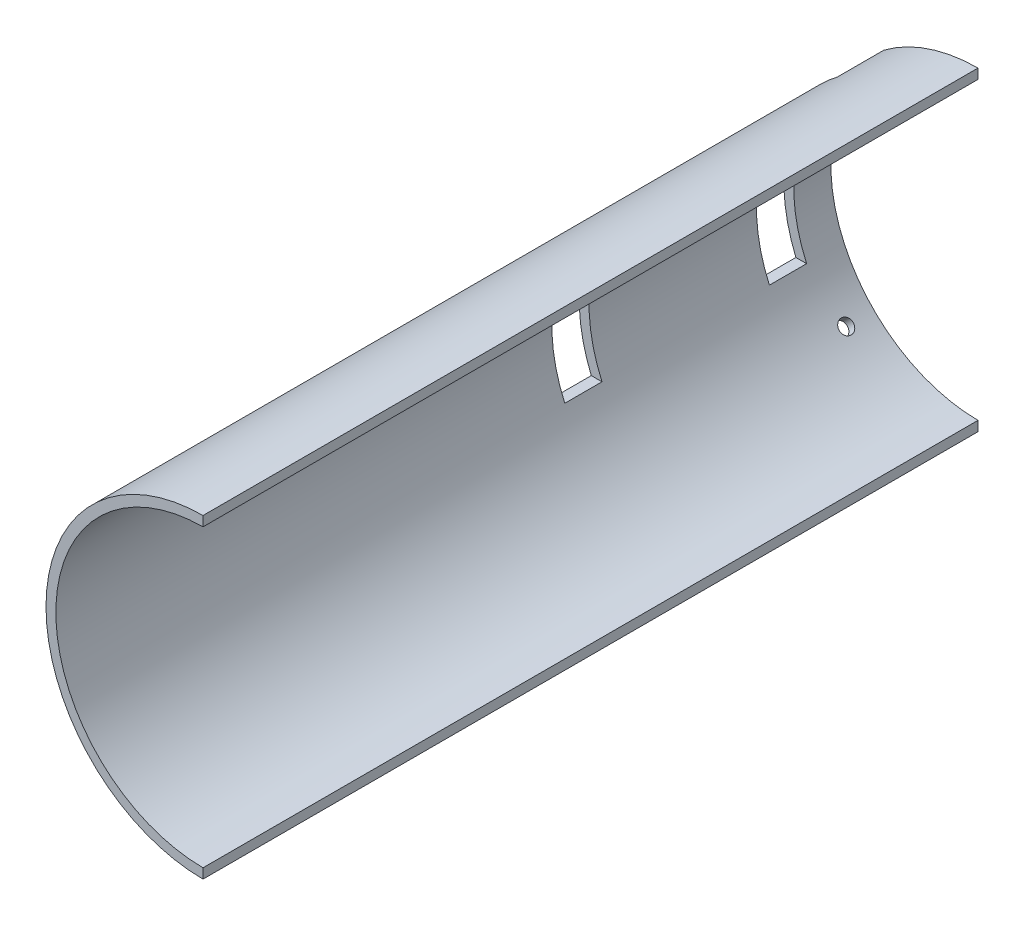
ISO-10303-21;
HEADER;
FILE_DESCRIPTION(('STEP AP214'),'2;1');
FILE_NAME('part.step','',(''),(''),'','','');
FILE_SCHEMA(('AUTOMOTIVE_DESIGN { 1 0 10303 214 1 1 1 1 }'));
ENDSEC;
DATA;
#1=APPLICATION_CONTEXT('core data for automotive mechanical design processes');
#2=APPLICATION_PROTOCOL_DEFINITION('international standard','automotive_design',2000,#1);
#3=PRODUCT_CONTEXT('',#1,'mechanical');
#4=PRODUCT('Part','Part','',(#3));
#5=PRODUCT_RELATED_PRODUCT_CATEGORY('part','',(#4));
#6=PRODUCT_DEFINITION_FORMATION('','',#4);
#7=PRODUCT_DEFINITION_CONTEXT('part definition',#1,'design');
#8=PRODUCT_DEFINITION('design','',#6,#7);
#9=PRODUCT_DEFINITION_SHAPE('','',#8);
#10=(LENGTH_UNIT() NAMED_UNIT(*) SI_UNIT(.MILLI.,.METRE.));
#11=(NAMED_UNIT(*) PLANE_ANGLE_UNIT() SI_UNIT($,.RADIAN.));
#12=(NAMED_UNIT(*) SI_UNIT($,.STERADIAN.) SOLID_ANGLE_UNIT());
#13=UNCERTAINTY_MEASURE_WITH_UNIT(LENGTH_MEASURE(1.E-05),#10,'distance_accuracy_value','');
#14=(GEOMETRIC_REPRESENTATION_CONTEXT(3) GLOBAL_UNCERTAINTY_ASSIGNED_CONTEXT((#13)) GLOBAL_UNIT_ASSIGNED_CONTEXT((#10,
#11,#12)) REPRESENTATION_CONTEXT('',''));
#15=CARTESIAN_POINT('',(0.,0.,0.));
#16=DIRECTION('',(0.,0.,1.));
#17=DIRECTION('',(1.,0.,0.));
#18=AXIS2_PLACEMENT_3D('',#15,#16,#17);
#19=CARTESIAN_POINT('',(0.,0.,250.));
#20=DIRECTION('',(0.,0.,-1.));
#21=DIRECTION('',(-1.,0.,0.));
#22=AXIS2_PLACEMENT_3D('',#19,#20,#21);
#23=CYLINDRICAL_SURFACE('',#22,50.8);
#24=CARTESIAN_POINT('',(0.,0.,250.));
#25=DIRECTION('',(0.,0.,1.));
#26=DIRECTION('',(1.,0.,0.));
#27=AXIS2_PLACEMENT_3D('',#24,#25,#26);
#28=CIRCLE('',#27,50.8);
#29=CARTESIAN_POINT('',(-0.150000000000013,50.7997785428243,250.));
#30=VERTEX_POINT('',#29);
#31=CARTESIAN_POINT('',(-0.150000000000013,-50.7997785428244,250.));
#32=VERTEX_POINT('',#31);
#33=EDGE_CURVE('E163',#30,#32,#28,.T.);
#34=ORIENTED_EDGE('',*,*,#33,.F.);
#35=DIRECTION('',(0.,0.,-1.));
#36=VECTOR('',#35,1.);
#37=CARTESIAN_POINT('',(-0.15,50.7997785428244,250.));
#38=LINE('',#37,#36);
#39=CARTESIAN_POINT('',(-0.15,50.7997785428244,0.));
#40=VERTEX_POINT('',#39);
#41=EDGE_CURVE('E366',#30,#40,#38,.T.);
#42=ORIENTED_EDGE('',*,*,#41,.T.);
#43=CARTESIAN_POINT('',(0.,0.,0.));
#44=DIRECTION('',(0.,0.,1.));
#45=DIRECTION('',(1.,0.,0.));
#46=AXIS2_PLACEMENT_3D('',#43,#44,#45);
#47=CIRCLE('',#46,50.8);
#48=CARTESIAN_POINT('',(-30.5400452331846,40.5948966885622,0.));
#49=VERTEX_POINT('',#48);
#50=EDGE_CURVE('E164',#40,#49,#47,.T.);
#51=ORIENTED_EDGE('',*,*,#50,.T.);
#52=DIRECTION('',(0.,0.,-1.));
#53=VECTOR('',#52,1.);
#54=CARTESIAN_POINT('',(-30.5400452331846,40.5948966885622,15.));
#55=LINE('',#54,#53);
#56=CARTESIAN_POINT('',(-30.5400452331846,40.5948966885622,15.));
#57=VERTEX_POINT('',#56);
#58=EDGE_CURVE('E194',#57,#49,#55,.T.);
#59=ORIENTED_EDGE('',*,*,#58,.F.);
#60=CARTESIAN_POINT('',(0.,0.,15.));
#61=DIRECTION('',(0.,0.,-1.));
#62=DIRECTION('',(-1.,0.,0.));
#63=AXIS2_PLACEMENT_3D('',#60,#61,#62);
#64=CIRCLE('',#63,50.8);
#65=CARTESIAN_POINT('',(-40.5948966885624,30.5400452331844,15.));
#66=VERTEX_POINT('',#65);
#67=EDGE_CURVE('E217',#66,#57,#64,.T.);
#68=ORIENTED_EDGE('',*,*,#67,.F.);
#69=DIRECTION('',(0.,0.,-1.));
#70=VECTOR('',#69,1.);
#71=CARTESIAN_POINT('',(-40.5948966885624,30.5400452331844,15.));
#72=LINE('',#71,#70);
#73=CARTESIAN_POINT('',(-40.5948966885624,30.5400452331844,0.));
#74=VERTEX_POINT('',#73);
#75=EDGE_CURVE('E219',#66,#74,#72,.T.);
#76=ORIENTED_EDGE('',*,*,#75,.T.);
#77=CARTESIAN_POINT('',(-40.5948966885625,-30.5400452331841,0.));
#78=VERTEX_POINT('',#77);
#79=EDGE_CURVE('E168',#74,#78,#47,.T.);
#80=ORIENTED_EDGE('',*,*,#79,.T.);
#81=DIRECTION('',(0.,0.,-1.));
#82=VECTOR('',#81,1.);
#83=CARTESIAN_POINT('',(-40.5948966885625,-30.5400452331841,15.));
#84=LINE('',#83,#82);
#85=CARTESIAN_POINT('',(-40.5948966885625,-30.5400452331841,15.));
#86=VERTEX_POINT('',#85);
#87=EDGE_CURVE('E198',#86,#78,#84,.T.);
#88=ORIENTED_EDGE('',*,*,#87,.F.);
#89=CARTESIAN_POINT('',(0.,0.,15.));
#90=DIRECTION('',(0.,0.,-1.));
#91=DIRECTION('',(0.,-1.,0.));
#92=AXIS2_PLACEMENT_3D('',#89,#90,#91);
#93=CIRCLE('',#92,50.8);
#94=CARTESIAN_POINT('',(-30.5400452331848,-40.594896688562,15.));
#95=VERTEX_POINT('',#94);
#96=EDGE_CURVE('E209',#95,#86,#93,.T.);
#97=ORIENTED_EDGE('',*,*,#96,.F.);
#98=DIRECTION('',(0.,0.,-1.));
#99=VECTOR('',#98,1.);
#100=CARTESIAN_POINT('',(-30.5400452331848,-40.594896688562,15.));
#101=LINE('',#100,#99);
#102=CARTESIAN_POINT('',(-30.5400452331848,-40.594896688562,0.));
#103=VERTEX_POINT('',#102);
#104=EDGE_CURVE('E203',#95,#103,#101,.T.);
#105=ORIENTED_EDGE('',*,*,#104,.T.);
#106=CARTESIAN_POINT('',(-0.150000000000013,-50.7997785428244,0.));
#107=VERTEX_POINT('',#106);
#108=EDGE_CURVE('E170',#103,#107,#47,.T.);
#109=ORIENTED_EDGE('',*,*,#108,.T.);
#110=DIRECTION('',(0.,0.,-1.));
#111=VECTOR('',#110,1.);
#112=CARTESIAN_POINT('',(-0.150000000000013,-50.7997785428244,250.));
#113=LINE('',#112,#111);
#114=EDGE_CURVE('E55',#107,#32,#113,.F.);
#115=ORIENTED_EDGE('',*,*,#114,.T.);
#116=EDGE_LOOP('',(#34,#42,#51,#59,#68,#76,#80,#88,#97,#105,#109,#115));
#117=FACE_BOUND('',#116,.T.);
#118=CARTESIAN_POINT('',(0.,0.,78.));
#119=DIRECTION('',(0.,0.,-1.));
#120=DIRECTION('',(-1.,0.,0.));
#121=AXIS2_PLACEMENT_3D('',#118,#119,#120);
#122=CIRCLE('',#121,50.8);
#123=CARTESIAN_POINT('',(-46.9083148279705,-19.5,78.));
#124=VERTEX_POINT('',#123);
#125=CARTESIAN_POINT('',(-46.9083148279705,19.5,78.));
#126=VERTEX_POINT('',#125);
#127=EDGE_CURVE('E258',#124,#126,#122,.T.);
#128=ORIENTED_EDGE('',*,*,#127,.T.);
#129=DIRECTION('',(0.,0.,-1.));
#130=VECTOR('',#129,1.);
#131=CARTESIAN_POINT('',(-46.9083148279705,19.5,250.));
#132=LINE('',#131,#130);
#133=CARTESIAN_POINT('',(-46.9083148279705,19.5,90.));
#134=VERTEX_POINT('',#133);
#135=EDGE_CURVE('E248',#134,#126,#132,.T.);
#136=ORIENTED_EDGE('',*,*,#135,.F.);
#137=CARTESIAN_POINT('',(0.,0.,90.));
#138=DIRECTION('',(0.,0.,-1.));
#139=DIRECTION('',(-1.,0.,0.));
#140=AXIS2_PLACEMENT_3D('',#137,#138,#139);
#141=CIRCLE('',#140,50.8);
#142=CARTESIAN_POINT('',(-46.9083148279705,-19.5,90.));
#143=VERTEX_POINT('',#142);
#144=EDGE_CURVE('E263',#143,#134,#141,.T.);
#145=ORIENTED_EDGE('',*,*,#144,.F.);
#146=DIRECTION('',(0.,0.,-1.));
#147=VECTOR('',#146,1.);
#148=CARTESIAN_POINT('',(-46.9083148279705,-19.5,250.));
#149=LINE('',#148,#147);
#150=EDGE_CURVE('E260',#143,#124,#149,.T.);
#151=ORIENTED_EDGE('',*,*,#150,.T.);
#152=EDGE_LOOP('',(#128,#136,#145,#151));
#153=FACE_BOUND('',#152,.T.);
#154=CARTESIAN_POINT('',(0.,0.,24.));
#155=DIRECTION('',(0.,0.,-1.));
#156=DIRECTION('',(0.,1.,0.));
#157=AXIS2_PLACEMENT_3D('',#154,#155,#156);
#158=CIRCLE('',#157,50.8);
#159=CARTESIAN_POINT('',(-46.9083148279705,-19.5000000000002,24.));
#160=VERTEX_POINT('',#159);
#161=CARTESIAN_POINT('',(-46.9083148279706,19.4999999999998,24.));
#162=VERTEX_POINT('',#161);
#163=EDGE_CURVE('E238',#160,#162,#158,.T.);
#164=ORIENTED_EDGE('',*,*,#163,.F.);
#165=DIRECTION('',(0.,0.,-1.));
#166=VECTOR('',#165,1.);
#167=CARTESIAN_POINT('',(-46.9083148279705,-19.5000000000001,250.));
#168=LINE('',#167,#166);
#169=CARTESIAN_POINT('',(-46.9083148279705,-19.5000000000002,12.));
#170=VERTEX_POINT('',#169);
#171=EDGE_CURVE('E228',#170,#160,#168,.F.);
#172=ORIENTED_EDGE('',*,*,#171,.F.);
#173=CARTESIAN_POINT('',(0.,0.,12.));
#174=DIRECTION('',(0.,0.,1.));
#175=DIRECTION('',(1.,0.,0.));
#176=AXIS2_PLACEMENT_3D('',#173,#174,#175);
#177=CIRCLE('',#176,50.8);
#178=CARTESIAN_POINT('',(-46.9083148279706,19.4999999999998,12.));
#179=VERTEX_POINT('',#178);
#180=EDGE_CURVE('E242',#179,#170,#177,.T.);
#181=ORIENTED_EDGE('',*,*,#180,.F.);
#182=DIRECTION('',(0.,0.,-1.));
#183=VECTOR('',#182,1.);
#184=CARTESIAN_POINT('',(-46.9083148279706,19.4999999999998,250.));
#185=LINE('',#184,#183);
#186=EDGE_CURVE('E240',#162,#179,#185,.T.);
#187=ORIENTED_EDGE('',*,*,#186,.F.);
#188=EDGE_LOOP('',(#164,#172,#181,#187));
#189=FACE_BOUND('',#188,.T.);
#190=ADVANCED_FACE('F34',(#117,#153,#189),#23,.T.);
#191=CARTESIAN_POINT('',(0.,0.,250.));
#192=DIRECTION('',(0.,0.,-1.));
#193=DIRECTION('',(-1.,0.,0.));
#194=AXIS2_PLACEMENT_3D('',#191,#192,#193);
#195=CYLINDRICAL_SURFACE('',#194,47.62);
#196=CARTESIAN_POINT('',(0.,0.,90.));
#197=DIRECTION('',(0.,0.,-1.));
#198=DIRECTION('',(-1.,0.,0.));
#199=AXIS2_PLACEMENT_3D('',#196,#197,#198);
#200=CIRCLE('',#199,47.62);
#201=CARTESIAN_POINT('',(-43.4443828359893,19.5,90.));
#202=VERTEX_POINT('',#201);
#203=CARTESIAN_POINT('',(-43.4443828359893,-19.5,90.));
#204=VERTEX_POINT('',#203);
#205=EDGE_CURVE('E181',#202,#204,#200,.F.);
#206=ORIENTED_EDGE('',*,*,#205,.F.);
#207=DIRECTION('',(0.,0.,-1.));
#208=VECTOR('',#207,1.);
#209=CARTESIAN_POINT('',(-43.4443828359893,19.5,250.));
#210=LINE('',#209,#208);
#211=CARTESIAN_POINT('',(-43.4443828359893,19.5,78.));
#212=VERTEX_POINT('',#211);
#213=EDGE_CURVE('E173',#212,#202,#210,.F.);
#214=ORIENTED_EDGE('',*,*,#213,.F.);
#215=CARTESIAN_POINT('',(0.,0.,78.));
#216=DIRECTION('',(0.,0.,-1.));
#217=DIRECTION('',(-1.,0.,0.));
#218=AXIS2_PLACEMENT_3D('',#215,#216,#217);
#219=CIRCLE('',#218,47.62);
#220=CARTESIAN_POINT('',(-43.4443828359893,-19.5,78.));
#221=VERTEX_POINT('',#220);
#222=EDGE_CURVE('E175',#212,#221,#219,.F.);
#223=ORIENTED_EDGE('',*,*,#222,.T.);
#224=DIRECTION('',(0.,0.,-1.));
#225=VECTOR('',#224,1.);
#226=CARTESIAN_POINT('',(-43.4443828359893,-19.5,250.));
#227=LINE('',#226,#225);
#228=EDGE_CURVE('E178',#221,#204,#227,.F.);
#229=ORIENTED_EDGE('',*,*,#228,.T.);
#230=EDGE_LOOP('',(#206,#214,#223,#229));
#231=FACE_BOUND('',#230,.T.);
#232=CARTESIAN_POINT('',(-32.0438272682221,-35.2258077835604,9.));
#233=CARTESIAN_POINT('',(-32.0438317176606,-35.2258043452638,9.12630778286549));
#234=CARTESIAN_POINT('',(-32.0517327135354,-35.2186214642248,9.25270535517174));
#235=CARTESIAN_POINT('',(-32.0831099876524,-35.1900395925316,9.50201425056569));
#236=CARTESIAN_POINT('',(-32.1066046597982,-35.1686238130729,9.62492127754036));
#237=CARTESIAN_POINT('',(-32.1684073118102,-35.1121021084725,9.86360147571088));
#238=CARTESIAN_POINT('',(-32.2067077911385,-35.0770031150932,9.97937822469137));
#239=CARTESIAN_POINT('',(-32.2968885961961,-34.993986981455,10.2005446278164));
#240=CARTESIAN_POINT('',(-32.3487656981291,-34.9460728841092,10.3059367396472));
#241=CARTESIAN_POINT('',(-32.4645135177405,-34.8385703926164,10.503470617082));
#242=CARTESIAN_POINT('',(-32.5283938237228,-34.7789726637837,10.5956016849744));
#243=CARTESIAN_POINT('',(-32.6661343175636,-34.6496316751259,10.7639071148954));
#244=CARTESIAN_POINT('',(-32.7399949109112,-34.5798880030726,10.840080828272));
#245=CARTESIAN_POINT('',(-32.8954652816068,-34.4320237607884,10.9743375279386));
#246=CARTESIAN_POINT('',(-32.9770785295229,-34.3538994368165,11.032412361777));
#247=CARTESIAN_POINT('',(-33.1455637198012,-34.1913686855799,11.1287703955119));
#248=CARTESIAN_POINT('',(-33.2324356254946,-34.1069623021194,11.1670537333979));
#249=CARTESIAN_POINT('',(-33.4087989560948,-33.9342270868281,11.2227142875572));
#250=CARTESIAN_POINT('',(-33.498288356545,-33.8459012604379,11.2401072449115));
#251=CARTESIAN_POINT('',(-33.6773561204862,-33.667729875027,11.2535418857352));
#252=CARTESIAN_POINT('',(-33.7669344833303,-33.5778843269855,11.2495837233886));
#253=CARTESIAN_POINT('',(-33.9435736803794,-33.3993109279266,11.220441567235));
#254=CARTESIAN_POINT('',(-34.0306364672355,-33.310582241911,11.1952745204841));
#255=CARTESIAN_POINT('',(-34.1999202965766,-33.1367557311199,11.124455259503));
#256=CARTESIAN_POINT('',(-34.2821413203619,-33.051657920368,11.078802966161));
#257=CARTESIAN_POINT('',(-34.4395665146779,-32.8875904242239,10.9682897674777));
#258=CARTESIAN_POINT('',(-34.5147678457146,-32.8086232208425,10.9034211329494));
#259=CARTESIAN_POINT('',(-34.6561484973245,-32.6592462440519,10.7563222882677));
#260=CARTESIAN_POINT('',(-34.7223277613815,-32.588836524249,10.6740919693651));
#261=CARTESIAN_POINT('',(-34.8440313252382,-32.4586790584133,10.4945081487276));
#262=CARTESIAN_POINT('',(-34.8995451479171,-32.3989418003937,10.397139944514));
#263=CARTESIAN_POINT('',(-34.9984414575166,-32.2920859277433,10.1900959598985));
#264=CARTESIAN_POINT('',(-35.0418239414631,-32.2449673162062,10.0804201764791));
#265=CARTESIAN_POINT('',(-35.1153829411626,-32.1648449986058,9.85186547552728));
#266=CARTESIAN_POINT('',(-35.1455590845932,-32.1318416904916,9.73298629863749));
#267=CARTESIAN_POINT('',(-35.1919616334504,-32.0810135587657,9.48940334781121));
#268=CARTESIAN_POINT('',(-35.2081881325768,-32.063188633201,9.36469961300419));
#269=CARTESIAN_POINT('',(-35.2262860346658,-32.043304398133,9.11313653740183));
#270=CARTESIAN_POINT('',(-35.2281713015452,-32.0412298624599,8.98627939730371));
#271=CARTESIAN_POINT('',(-35.2175773789759,-32.0528735548305,8.7338970421207));
#272=CARTESIAN_POINT('',(-35.2050982318605,-32.0665917363316,8.60837182311161));
#273=CARTESIAN_POINT('',(-35.1660889155332,-32.1093665305668,8.36227422305958));
#274=CARTESIAN_POINT('',(-35.1395651045954,-32.1384162024376,8.24169962737464));
#275=CARTESIAN_POINT('',(-35.0731193588191,-32.2109158878136,8.00885775451115));
#276=CARTESIAN_POINT('',(-35.0331973548627,-32.254365975607,7.89659052019187));
#277=CARTESIAN_POINT('',(-34.9409040075854,-32.3543233664124,7.6834555680646));
#278=CARTESIAN_POINT('',(-34.8885231219751,-32.4108406767122,7.58259667573459));
#279=CARTESIAN_POINT('',(-34.7726379788124,-32.5351386761527,7.39523017534742));
#280=CARTESIAN_POINT('',(-34.7091336573104,-32.6029194300476,7.30872264980292));
#281=CARTESIAN_POINT('',(-34.5725635329844,-32.7477043956557,7.15244546512262));
#282=CARTESIAN_POINT('',(-34.4994902130569,-32.8247158546494,7.08268908853794));
#283=CARTESIAN_POINT('',(-34.3457257783463,-32.9855708420563,6.96198512360319));
#284=CARTESIAN_POINT('',(-34.2650346940645,-33.0694143431139,6.9110374599474));
#285=CARTESIAN_POINT('',(-34.0982267238973,-33.2413848400652,6.8294203826961));
#286=CARTESIAN_POINT('',(-34.0121121329903,-33.329510020589,6.7987424541953));
#287=CARTESIAN_POINT('',(-33.8367889952503,-33.507487336346,6.75850779156319));
#288=CARTESIAN_POINT('',(-33.7475804634085,-33.5973394632107,6.74895095510887));
#289=CARTESIAN_POINT('',(-33.5686679189427,-33.7760996930285,6.75123075715785));
#290=CARTESIAN_POINT('',(-33.4789644741016,-33.8650086308576,6.76304654977187));
#291=CARTESIAN_POINT('',(-33.3015560065154,-34.0394807961206,6.80769313909201));
#292=CARTESIAN_POINT('',(-33.2138509875739,-34.1250440171868,6.84052397579308));
#293=CARTESIAN_POINT('',(-33.0430157899659,-34.2904893420114,6.92626456071771));
#294=CARTESIAN_POINT('',(-32.9598856544803,-34.3703713921491,6.97917449842435));
#295=CARTESIAN_POINT('',(-32.8006925644056,-34.5223274396228,7.10356750226263));
#296=CARTESIAN_POINT('',(-32.7246293865441,-34.5944016836493,7.17504998134511));
#297=CARTESIAN_POINT('',(-32.5818218431517,-34.728935136089,7.33463268471658));
#298=CARTESIAN_POINT('',(-32.5150856083365,-34.7913859601392,7.42274725261249));
#299=CARTESIAN_POINT('',(-32.3930642636242,-34.9050248528353,7.61308699964514));
#300=CARTESIAN_POINT('',(-32.337781978139,-34.956210143724,7.71531564882038));
#301=CARTESIAN_POINT('',(-32.2403871329649,-35.0460589215576,7.93105526626097));
#302=CARTESIAN_POINT('',(-32.1982865650781,-35.0847110078044,8.04457638464772));
#303=CARTESIAN_POINT('',(-32.1287069515606,-35.1484400335049,8.27952036326755));
#304=CARTESIAN_POINT('',(-32.1012106079417,-35.1735330336465,8.40093368330762));
#305=CARTESIAN_POINT('',(-32.0689491523498,-35.2029425642609,8.60258624730247));
#306=CARTESIAN_POINT('',(-32.0595417666715,-35.2115074234496,8.68151886590007));
#307=CARTESIAN_POINT('',(-32.046979420133,-35.2229411180766,8.84028902137894));
#308=CARTESIAN_POINT('',(-32.0438244545239,-35.2258099578413,8.92012655757285));
#309=CARTESIAN_POINT('',(-32.0438272682221,-35.2258077835604,9.));
#310=B_SPLINE_CURVE_WITH_KNOTS('',3,(#232,#233,#234,#235,#236,#237,#238,#239,#240,#241,#242,
#243,#244,#245,#246,#247,#248,#249,#250,#251,#252,#253,#254,#255,#256,#257,#258,#259,#260,#261,
#262,#263,#264,#265,#266,#267,#268,#269,#270,#271,#272,#273,#274,#275,#276,#277,#278,#279,#280,
#281,#282,#283,#284,#285,#286,#287,#288,#289,#290,#291,#292,#293,#294,#295,#296,#297,#298,#299,
#300,#301,#302,#303,#304,#305,#306,#307,#308,#309),.UNSPECIFIED.,.T.,.F.,(4,2,2,2,2,2,2,2,2,2,2,
2,2,2,2,2,2,2,2,2,2,2,2,2,2,2,2,2,2,2,2,2,2,2,2,2,2,2,4),(0.,0.378631783224871,
0.757710986511355,1.1365984015579,1.5153959305247,1.89449734389449,2.27361416440516,
2.65290150813592,3.0321862073799,3.41118493269032,3.79018092111968,4.16887435790151,
4.54756925717147,4.92641668220433,5.3052664803106,5.684486556974,6.06370672660917,
6.44293758679779,6.82216589967434,7.20102755934902,7.57988810248495,7.95857727503818,
8.3372684011852,8.7162505071328,9.09523479194838,9.47451860118141,9.85380089183397,
10.2329237522061,10.6120447758798,10.9907962215405,11.3695483880276,11.7483041288237,
12.1270478991958,12.5061198051503,12.8852850749061,13.26479428707,13.6438529810352,
13.8832891125422,14.1227250621915),.UNSPECIFIED.);
#311=CARTESIAN_POINT('',(-32.0438272682221,-35.2258077835604,9.));
#312=VERTEX_POINT('',#311);
#313=EDGE_CURVE('E266',#312,#312,#310,.T.);
#314=ORIENTED_EDGE('',*,*,#313,.T.);
#315=EDGE_LOOP('',(#314));
#316=FACE_BOUND('',#315,.T.);
#317=CARTESIAN_POINT('',(-35.225807783561,32.0438272682214,9.));
#318=CARTESIAN_POINT('',(-35.2258043452644,32.0438317176599,9.12630778286549));
#319=CARTESIAN_POINT('',(-35.2186214642254,32.0517327135347,9.25270535517174));
#320=CARTESIAN_POINT('',(-35.1900395925322,32.0831099876517,9.50201425056569));
#321=CARTESIAN_POINT('',(-35.1686238130735,32.1066046597975,9.62492127754036));
#322=CARTESIAN_POINT('',(-35.1121021084731,32.1684073118095,9.86360147571087));
#323=CARTESIAN_POINT('',(-35.0770031150938,32.2067077911378,9.97937822469137));
#324=CARTESIAN_POINT('',(-34.9939869814556,32.2968885961955,10.2005446278164));
#325=CARTESIAN_POINT('',(-34.9460728841097,32.3487656981285,10.3059367396472));
#326=CARTESIAN_POINT('',(-34.8385703926169,32.4645135177399,10.503470617082));
#327=CARTESIAN_POINT('',(-34.7789726637842,32.5283938237222,10.5956016849744));
#328=CARTESIAN_POINT('',(-34.6496316751265,32.666134317563,10.7639071148954));
#329=CARTESIAN_POINT('',(-34.5798880030732,32.7399949109106,10.840080828272));
#330=CARTESIAN_POINT('',(-34.432023760789,32.8954652816062,10.9743375279386));
#331=CARTESIAN_POINT('',(-34.3538994368171,32.9770785295223,11.0324123617769));
#332=CARTESIAN_POINT('',(-34.1913686855805,33.1455637198006,11.1287703955119));
#333=CARTESIAN_POINT('',(-34.10696230212,33.232435625494,11.1670537333979));
#334=CARTESIAN_POINT('',(-33.9342270868287,33.4087989560942,11.2227142875572));
#335=CARTESIAN_POINT('',(-33.8459012604385,33.4982883565443,11.2401072449115));
#336=CARTESIAN_POINT('',(-33.6677298750276,33.6773561204856,11.2535418857352));
#337=CARTESIAN_POINT('',(-33.5778843269861,33.7669344833297,11.2495837233886));
#338=CARTESIAN_POINT('',(-33.3993109279272,33.9435736803788,11.220441567235));
#339=CARTESIAN_POINT('',(-33.3105822419116,34.0306364672349,11.1952745204841));
#340=CARTESIAN_POINT('',(-33.1367557311205,34.199920296576,11.124455259503));
#341=CARTESIAN_POINT('',(-33.0516579203686,34.2821413203613,11.078802966161));
#342=CARTESIAN_POINT('',(-32.8875904242246,34.4395665146774,10.9682897674777));
#343=CARTESIAN_POINT('',(-32.8086232208431,34.514767845714,10.9034211329494));
#344=CARTESIAN_POINT('',(-32.6592462440525,34.6561484973239,10.7563222882677));
#345=CARTESIAN_POINT('',(-32.5888365242496,34.7223277613809,10.6740919693651));
#346=CARTESIAN_POINT('',(-32.4586790584139,34.8440313252377,10.4945081487276));
#347=CARTESIAN_POINT('',(-32.3989418003943,34.8995451479165,10.397139944514));
#348=CARTESIAN_POINT('',(-32.2920859277439,34.998441457516,10.1900959598985));
#349=CARTESIAN_POINT('',(-32.2449673162069,35.0418239414625,10.0804201764791));
#350=CARTESIAN_POINT('',(-32.1648449986064,35.115382941162,9.85186547552729));
#351=CARTESIAN_POINT('',(-32.1318416904922,35.1455590845926,9.73298629863749));
#352=CARTESIAN_POINT('',(-32.0810135587664,35.1919616334498,9.48940334781122));
#353=CARTESIAN_POINT('',(-32.0631886332016,35.2081881325762,9.3646996130042));
#354=CARTESIAN_POINT('',(-32.0433043981337,35.2262860346652,9.11313653740183));
#355=CARTESIAN_POINT('',(-32.0412298624605,35.2281713015446,8.98627939730371));
#356=CARTESIAN_POINT('',(-32.0528735548311,35.2175773789753,8.7338970421207));
#357=CARTESIAN_POINT('',(-32.0665917363322,35.2050982318599,8.60837182311161));
#358=CARTESIAN_POINT('',(-32.1093665305675,35.1660889155326,8.36227422305959));
#359=CARTESIAN_POINT('',(-32.1384162024382,35.1395651045948,8.24169962737464));
#360=CARTESIAN_POINT('',(-32.2109158878142,35.0731193588186,8.00885775451115));
#361=CARTESIAN_POINT('',(-32.2543659756077,35.0331973548621,7.89659052019187));
#362=CARTESIAN_POINT('',(-32.354323366413,34.9409040075849,7.68345556806461));
#363=CARTESIAN_POINT('',(-32.4108406767129,34.8885231219746,7.58259667573459));
#364=CARTESIAN_POINT('',(-32.5351386761533,34.7726379788118,7.39523017534742));
#365=CARTESIAN_POINT('',(-32.6029194300483,34.7091336573098,7.30872264980292));
#366=CARTESIAN_POINT('',(-32.7477043956563,34.5725635329839,7.15244546512262));
#367=CARTESIAN_POINT('',(-32.8247158546501,34.4994902130563,7.08268908853794));
#368=CARTESIAN_POINT('',(-32.985570842057,34.3457257783457,6.96198512360319));
#369=CARTESIAN_POINT('',(-33.0694143431145,34.2650346940639,6.9110374599474));
#370=CARTESIAN_POINT('',(-33.2413848400658,34.0982267238967,6.8294203826961));
#371=CARTESIAN_POINT('',(-33.3295100205897,34.0121121329897,6.7987424541953));
#372=CARTESIAN_POINT('',(-33.5074873363466,33.8367889952497,6.75850779156319));
#373=CARTESIAN_POINT('',(-33.5973394632113,33.7475804634079,6.74895095510887));
#374=CARTESIAN_POINT('',(-33.7760996930291,33.5686679189421,6.75123075715785));
#375=CARTESIAN_POINT('',(-33.8650086308582,33.478964474101,6.76304654977188));
#376=CARTESIAN_POINT('',(-34.0394807961212,33.3015560065148,6.80769313909201));
#377=CARTESIAN_POINT('',(-34.1250440171874,33.2138509875733,6.84052397579308));
#378=CARTESIAN_POINT('',(-34.290489342012,33.0430157899653,6.92626456071771));
#379=CARTESIAN_POINT('',(-34.3703713921497,32.9598856544797,6.97917449842435));
#380=CARTESIAN_POINT('',(-34.5223274396233,32.800692564405,7.10356750226263));
#381=CARTESIAN_POINT('',(-34.5944016836498,32.7246293865435,7.17504998134511));
#382=CARTESIAN_POINT('',(-34.7289351360896,32.5818218431511,7.33463268471658));
#383=CARTESIAN_POINT('',(-34.7913859601398,32.5150856083359,7.42274725261249));
#384=CARTESIAN_POINT('',(-34.9050248528359,32.3930642636236,7.61308699964515));
#385=CARTESIAN_POINT('',(-34.9562101437246,32.3377819781384,7.71531564882038));
#386=CARTESIAN_POINT('',(-35.0460589215582,32.2403871329643,7.93105526626097));
#387=CARTESIAN_POINT('',(-35.084711007805,32.1982865650774,8.04457638464773));
#388=CARTESIAN_POINT('',(-35.1484400335055,32.1287069515599,8.27952036326755));
#389=CARTESIAN_POINT('',(-35.1735330336471,32.101210607941,8.40093368330762));
#390=CARTESIAN_POINT('',(-35.2029425642614,32.0689491523492,8.60258624730247));
#391=CARTESIAN_POINT('',(-35.2115074234502,32.0595417666709,8.68151886590007));
#392=CARTESIAN_POINT('',(-35.2229411180772,32.0469794201323,8.84028902137894));
#393=CARTESIAN_POINT('',(-35.2258099578418,32.0438244545233,8.92012655757285));
#394=CARTESIAN_POINT('',(-35.225807783561,32.0438272682214,9.));
#395=B_SPLINE_CURVE_WITH_KNOTS('',3,(#317,#318,#319,#320,#321,#322,#323,#324,#325,#326,#327,
#328,#329,#330,#331,#332,#333,#334,#335,#336,#337,#338,#339,#340,#341,#342,#343,#344,#345,#346,
#347,#348,#349,#350,#351,#352,#353,#354,#355,#356,#357,#358,#359,#360,#361,#362,#363,#364,#365,
#366,#367,#368,#369,#370,#371,#372,#373,#374,#375,#376,#377,#378,#379,#380,#381,#382,#383,#384,
#385,#386,#387,#388,#389,#390,#391,#392,#393,#394),.UNSPECIFIED.,.T.,.F.,(4,2,2,2,2,2,2,2,2,2,2,
2,2,2,2,2,2,2,2,2,2,2,2,2,2,2,2,2,2,2,2,2,2,2,2,2,2,2,4),(0.,0.378631783224869,
0.757710986511355,1.13659840155789,1.51539593052471,1.8944973438945,2.27361416440515,
2.65290150813591,3.03218620737989,3.41118493269031,3.79018092111968,4.16887435790151,
4.54756925717147,4.92641668220434,5.30526648031061,5.684486556974,6.06370672660917,
6.44293758679779,6.82216589967434,7.20102755934902,7.57988810248495,7.95857727503818,
8.33726840118519,8.7162505071328,9.09523479194837,9.47451860118141,9.85380089183397,
10.2329237522061,10.6120447758799,10.9907962215405,11.3695483880276,11.7483041288237,
12.1270478991958,12.5061198051503,12.8852850749061,13.26479428707,13.6438529810352,
13.8832891125422,14.1227250621915),.UNSPECIFIED.);
#396=CARTESIAN_POINT('',(-35.225807783561,32.0438272682214,9.));
#397=VERTEX_POINT('',#396);
#398=EDGE_CURVE('E272',#397,#397,#395,.T.);
#399=ORIENTED_EDGE('',*,*,#398,.T.);
#400=EDGE_LOOP('',(#399));
#401=FACE_BOUND('',#400,.T.);
#402=CARTESIAN_POINT('',(0.,0.,0.));
#403=DIRECTION('',(0.,0.,-1.));
#404=DIRECTION('',(1.,0.,0.));
#405=AXIS2_PLACEMENT_3D('',#402,#403,#404);
#406=CIRCLE('',#405,47.62);
#407=CARTESIAN_POINT('',(-0.150000000000012,-47.6197637541389,0.));
#408=VERTEX_POINT('',#407);
#409=CARTESIAN_POINT('',(-0.150000000000001,47.6197637541389,0.));
#410=VERTEX_POINT('',#409);
#411=EDGE_CURVE('E156',#408,#410,#406,.T.);
#412=ORIENTED_EDGE('',*,*,#411,.T.);
#413=DIRECTION('',(0.,0.,-1.));
#414=VECTOR('',#413,1.);
#415=CARTESIAN_POINT('',(-0.150000000000001,47.6197637541389,250.));
#416=LINE('',#415,#414);
#417=CARTESIAN_POINT('',(-0.150000000000013,47.6197637541389,250.));
#418=VERTEX_POINT('',#417);
#419=EDGE_CURVE('E48',#410,#418,#416,.F.);
#420=ORIENTED_EDGE('',*,*,#419,.T.);
#421=CARTESIAN_POINT('',(0.,0.,250.));
#422=DIRECTION('',(0.,0.,-1.));
#423=DIRECTION('',(1.,0.,0.));
#424=AXIS2_PLACEMENT_3D('',#421,#422,#423);
#425=CIRCLE('',#424,47.62);
#426=CARTESIAN_POINT('',(-0.150000000000013,-47.6197637541389,250.));
#427=VERTEX_POINT('',#426);
#428=EDGE_CURVE('E158',#427,#418,#425,.T.);
#429=ORIENTED_EDGE('',*,*,#428,.F.);
#430=DIRECTION('',(0.,0.,-1.));
#431=VECTOR('',#430,1.);
#432=CARTESIAN_POINT('',(-0.150000000000012,-47.6197637541389,250.));
#433=LINE('',#432,#431);
#434=EDGE_CURVE('E144',#427,#408,#433,.T.);
#435=ORIENTED_EDGE('',*,*,#434,.T.);
#436=EDGE_LOOP('',(#412,#420,#429,#435));
#437=FACE_BOUND('',#436,.T.);
#438=CARTESIAN_POINT('',(0.,0.,12.));
#439=DIRECTION('',(0.,0.,1.));
#440=DIRECTION('',(1.,0.,0.));
#441=AXIS2_PLACEMENT_3D('',#438,#439,#440);
#442=CIRCLE('',#441,47.62);
#443=CARTESIAN_POINT('',(-43.4443828359892,-19.5000000000002,12.));
#444=VERTEX_POINT('',#443);
#445=CARTESIAN_POINT('',(-43.4443828359894,19.4999999999998,12.));
#446=VERTEX_POINT('',#445);
#447=EDGE_CURVE('E150',#444,#446,#442,.F.);
#448=ORIENTED_EDGE('',*,*,#447,.F.);
#449=DIRECTION('',(0.,0.,-1.));
#450=VECTOR('',#449,1.);
#451=CARTESIAN_POINT('',(-43.4443828359892,-19.5000000000001,250.));
#452=LINE('',#451,#450);
#453=CARTESIAN_POINT('',(-43.4443828359892,-19.5000000000001,24.));
#454=VERTEX_POINT('',#453);
#455=EDGE_CURVE('E183',#454,#444,#452,.T.);
#456=ORIENTED_EDGE('',*,*,#455,.F.);
#457=CARTESIAN_POINT('',(0.,0.,24.));
#458=DIRECTION('',(0.,0.,-1.));
#459=DIRECTION('',(0.,1.,0.));
#460=AXIS2_PLACEMENT_3D('',#457,#458,#459);
#461=CIRCLE('',#460,47.62);
#462=CARTESIAN_POINT('',(-43.4443828359894,19.4999999999998,24.));
#463=VERTEX_POINT('',#462);
#464=EDGE_CURVE('E185',#463,#454,#461,.F.);
#465=ORIENTED_EDGE('',*,*,#464,.F.);
#466=DIRECTION('',(0.,0.,-1.));
#467=VECTOR('',#466,1.);
#468=CARTESIAN_POINT('',(-43.4443828359894,19.4999999999998,250.));
#469=LINE('',#468,#467);
#470=EDGE_CURVE('E188',#446,#463,#469,.F.);
#471=ORIENTED_EDGE('',*,*,#470,.F.);
#472=EDGE_LOOP('',(#448,#456,#465,#471));
#473=FACE_BOUND('',#472,.T.);
#474=ADVANCED_FACE('F154',(#231,#316,#401,#437,#473),#195,.F.);
#475=CARTESIAN_POINT('',(0.,0.,250.));
#476=DIRECTION('',(0.,0.,1.));
#477=DIRECTION('',(1.,0.,0.));
#478=AXIS2_PLACEMENT_3D('',#475,#476,#477);
#479=PLANE('',#478);
#480=DIRECTION('',(0.,1.,0.));
#481=VECTOR('',#480,1.);
#482=CARTESIAN_POINT('',(-0.150000000000013,-50.7997785428244,250.));
#483=LINE('',#482,#481);
#484=EDGE_CURVE('E474',#418,#30,#483,.T.);
#485=ORIENTED_EDGE('',*,*,#484,.T.);
#486=ORIENTED_EDGE('',*,*,#33,.T.);
#487=EDGE_CURVE('E159',#32,#427,#483,.T.);
#488=ORIENTED_EDGE('',*,*,#487,.T.);
#489=ORIENTED_EDGE('',*,*,#428,.T.);
#490=EDGE_LOOP('',(#485,#486,#488,#489));
#491=FACE_BOUND('',#490,.T.);
#492=ADVANCED_FACE('F289',(#491),#479,.T.);
#493=CARTESIAN_POINT('',(0.,0.,0.));
#494=DIRECTION('',(0.,0.,1.));
#495=DIRECTION('',(1.,0.,0.));
#496=AXIS2_PLACEMENT_3D('',#493,#494,#495);
#497=PLANE('',#496);
#498=ORIENTED_EDGE('',*,*,#50,.F.);
#499=DIRECTION('',(0.,-1.,0.));
#500=VECTOR('',#499,1.);
#501=CARTESIAN_POINT('',(-0.150000000000006,0.,0.));
#502=LINE('',#501,#500);
#503=EDGE_CURVE('E11',#40,#410,#502,.T.);
#504=ORIENTED_EDGE('',*,*,#503,.T.);
#505=ORIENTED_EDGE('',*,*,#411,.F.);
#506=EDGE_CURVE('E37',#408,#107,#502,.T.);
#507=ORIENTED_EDGE('',*,*,#506,.T.);
#508=ORIENTED_EDGE('',*,*,#108,.F.);
#509=DIRECTION('',(0.707106781186542,-0.707106781186554,0.));
#510=VECTOR('',#509,1.);
#511=CARTESIAN_POINT('',(-35.5674709608737,-35.5674709608731,0.));
#512=LINE('',#511,#510);
#513=EDGE_CURVE('E212',#78,#103,#512,.T.);
#514=ORIENTED_EDGE('',*,*,#513,.F.);
#515=ORIENTED_EDGE('',*,*,#79,.F.);
#516=DIRECTION('',(-0.707106781186546,-0.707106781186549,0.));
#517=VECTOR('',#516,1.);
#518=CARTESIAN_POINT('',(-35.5674709608735,35.5674709608733,0.));
#519=LINE('',#518,#517);
#520=EDGE_CURVE('E197',#49,#74,#519,.T.);
#521=ORIENTED_EDGE('',*,*,#520,.F.);
#522=EDGE_LOOP('',(#498,#504,#505,#507,#508,#514,#515,#521));
#523=FACE_BOUND('',#522,.T.);
#524=ADVANCED_FACE('F162',(#523),#497,.F.);
#525=CARTESIAN_POINT('',(-35.9210244842767,35.9210244842766,9.));
#526=DIRECTION('',(-0.707106781186549,0.707106781186546,0.));
#527=DIRECTION('',(-0.707106781186546,-0.707106781186549,0.));
#528=AXIS2_PLACEMENT_3D('',#525,#526,#527);
#529=CYLINDRICAL_SURFACE('',#528,2.25);
#530=CARTESIAN_POINT('',(-35.5674709608735,35.5674709608733,9.));
#531=DIRECTION('',(0.707106781186549,-0.707106781186546,0.));
#532=DIRECTION('',(0.707106781186546,0.707106781186549,0.));
#533=AXIS2_PLACEMENT_3D('',#530,#531,#532);
#534=CIRCLE('',#533,2.25);
#535=CARTESIAN_POINT('',(-33.9764807032037,37.158461218543,9.));
#536=VERTEX_POINT('',#535);
#537=EDGE_CURVE('E191',#536,#536,#534,.F.);
#538=ORIENTED_EDGE('',*,*,#537,.T.);
#539=EDGE_LOOP('',(#538));
#540=FACE_BOUND('',#539,.T.);
#541=ORIENTED_EDGE('',*,*,#398,.F.);
#542=EDGE_LOOP('',(#541));
#543=FACE_BOUND('',#542,.T.);
#544=ADVANCED_FACE('F283',(#540,#543),#529,.F.);
#545=CARTESIAN_POINT('',(-35.9210244842772,-35.921024484276,9.));
#546=DIRECTION('',(-0.707106781186559,-0.707106781186536,0.));
#547=DIRECTION('',(0.707106781186536,-0.707106781186559,0.));
#548=AXIS2_PLACEMENT_3D('',#545,#546,#547);
#549=CYLINDRICAL_SURFACE('',#548,2.25);
#550=CARTESIAN_POINT('',(-35.567470960874,-35.5674709608728,9.));
#551=DIRECTION('',(0.707106781186553,0.707106781186541,0.));
#552=DIRECTION('',(-0.707106781186542,0.707106781186554,0.));
#553=AXIS2_PLACEMENT_3D('',#550,#551,#552);
#554=CIRCLE('',#553,2.25);
#555=CARTESIAN_POINT('',(-37.1584612185437,-33.9764807032031,9.));
#556=VERTEX_POINT('',#555);
#557=EDGE_CURVE('E195',#556,#556,#554,.F.);
#558=ORIENTED_EDGE('',*,*,#557,.T.);
#559=EDGE_LOOP('',(#558));
#560=FACE_BOUND('',#559,.T.);
#561=ORIENTED_EDGE('',*,*,#313,.F.);
#562=EDGE_LOOP('',(#561));
#563=FACE_BOUND('',#562,.T.);
#564=ADVANCED_FACE('F278',(#560,#563),#549,.F.);
#565=CARTESIAN_POINT('',(-40.8,0.,90.));
#566=DIRECTION('',(0.,0.,-1.));
#567=DIRECTION('',(-1.,0.,0.));
#568=AXIS2_PLACEMENT_3D('',#565,#566,#567);
#569=PLANE('',#568);
#570=ORIENTED_EDGE('',*,*,#144,.T.);
#571=DIRECTION('',(-1.,0.,0.));
#572=VECTOR('',#571,1.);
#573=CARTESIAN_POINT('',(-40.8,19.5,90.));
#574=LINE('',#573,#572);
#575=EDGE_CURVE('E244',#202,#134,#574,.T.);
#576=ORIENTED_EDGE('',*,*,#575,.F.);
#577=ORIENTED_EDGE('',*,*,#205,.T.);
#578=DIRECTION('',(-1.,0.,0.));
#579=VECTOR('',#578,1.);
#580=CARTESIAN_POINT('',(-40.8,-19.5,90.));
#581=LINE('',#580,#579);
#582=EDGE_CURVE('E245',#204,#143,#581,.T.);
#583=ORIENTED_EDGE('',*,*,#582,.T.);
#584=EDGE_LOOP('',(#570,#576,#577,#583));
#585=FACE_BOUND('',#584,.T.);
#586=ADVANCED_FACE('F282',(#585),#569,.T.);
#587=CARTESIAN_POINT('',(-40.8,-19.5,0.));
#588=DIRECTION('',(0.,-1.,0.));
#589=DIRECTION('',(0.,0.,-1.));
#590=AXIS2_PLACEMENT_3D('',#587,#588,#589);
#591=PLANE('',#590);
#592=ORIENTED_EDGE('',*,*,#582,.F.);
#593=ORIENTED_EDGE('',*,*,#228,.F.);
#594=DIRECTION('',(-1.,0.,0.));
#595=VECTOR('',#594,1.);
#596=CARTESIAN_POINT('',(-40.8,-19.5,78.));
#597=LINE('',#596,#595);
#598=EDGE_CURVE('E249',#221,#124,#597,.T.);
#599=ORIENTED_EDGE('',*,*,#598,.T.);
#600=ORIENTED_EDGE('',*,*,#150,.F.);
#601=EDGE_LOOP('',(#592,#593,#599,#600));
#602=FACE_BOUND('',#601,.T.);
#603=ADVANCED_FACE('F338',(#602),#591,.F.);
#604=CARTESIAN_POINT('',(-40.8,0.,78.));
#605=DIRECTION('',(0.,0.,-1.));
#606=DIRECTION('',(-1.,0.,0.));
#607=AXIS2_PLACEMENT_3D('',#604,#605,#606);
#608=PLANE('',#607);
#609=ORIENTED_EDGE('',*,*,#127,.F.);
#610=ORIENTED_EDGE('',*,*,#598,.F.);
#611=ORIENTED_EDGE('',*,*,#222,.F.);
#612=DIRECTION('',(-1.,0.,0.));
#613=VECTOR('',#612,1.);
#614=CARTESIAN_POINT('',(-40.8,19.5,78.));
#615=LINE('',#614,#613);
#616=EDGE_CURVE('E252',#212,#126,#615,.T.);
#617=ORIENTED_EDGE('',*,*,#616,.T.);
#618=EDGE_LOOP('',(#609,#610,#611,#617));
#619=FACE_BOUND('',#618,.T.);
#620=ADVANCED_FACE('F333',(#619),#608,.F.);
#621=CARTESIAN_POINT('',(-40.8,19.5,0.));
#622=DIRECTION('',(0.,-1.,0.));
#623=DIRECTION('',(0.,0.,-1.));
#624=AXIS2_PLACEMENT_3D('',#621,#622,#623);
#625=PLANE('',#624);
#626=ORIENTED_EDGE('',*,*,#135,.T.);
#627=ORIENTED_EDGE('',*,*,#616,.F.);
#628=ORIENTED_EDGE('',*,*,#213,.T.);
#629=ORIENTED_EDGE('',*,*,#575,.T.);
#630=EDGE_LOOP('',(#626,#627,#628,#629));
#631=FACE_BOUND('',#630,.T.);
#632=ADVANCED_FACE('F326',(#631),#625,.T.);
#633=CARTESIAN_POINT('',(-40.8,0.,12.));
#634=DIRECTION('',(0.,0.,1.));
#635=DIRECTION('',(1.,0.,0.));
#636=AXIS2_PLACEMENT_3D('',#633,#634,#635);
#637=PLANE('',#636);
#638=ORIENTED_EDGE('',*,*,#180,.T.);
#639=DIRECTION('',(-1.,0.,0.));
#640=VECTOR('',#639,1.);
#641=CARTESIAN_POINT('',(-40.8,-19.5000000000002,12.));
#642=LINE('',#641,#640);
#643=EDGE_CURVE('E193',#444,#170,#642,.T.);
#644=ORIENTED_EDGE('',*,*,#643,.F.);
#645=ORIENTED_EDGE('',*,*,#447,.T.);
#646=DIRECTION('',(-1.,0.,0.));
#647=VECTOR('',#646,1.);
#648=CARTESIAN_POINT('',(-40.8,19.4999999999998,12.));
#649=LINE('',#648,#647);
#650=EDGE_CURVE('E225',#446,#179,#649,.T.);
#651=ORIENTED_EDGE('',*,*,#650,.T.);
#652=EDGE_LOOP('',(#638,#644,#645,#651));
#653=FACE_BOUND('',#652,.T.);
#654=ADVANCED_FACE('F324',(#653),#637,.T.);
#655=CARTESIAN_POINT('',(-40.8,19.4999999999998,0.));
#656=DIRECTION('',(0.,-1.,0.));
#657=DIRECTION('',(0.,0.,-1.));
#658=AXIS2_PLACEMENT_3D('',#655,#656,#657);
#659=PLANE('',#658);
#660=ORIENTED_EDGE('',*,*,#186,.T.);
#661=ORIENTED_EDGE('',*,*,#650,.F.);
#662=ORIENTED_EDGE('',*,*,#470,.T.);
#663=DIRECTION('',(-1.,0.,0.));
#664=VECTOR('',#663,1.);
#665=CARTESIAN_POINT('',(-40.8,19.4999999999998,24.));
#666=LINE('',#665,#664);
#667=EDGE_CURVE('E229',#463,#162,#666,.T.);
#668=ORIENTED_EDGE('',*,*,#667,.T.);
#669=EDGE_LOOP('',(#660,#661,#662,#668));
#670=FACE_BOUND('',#669,.T.);
#671=ADVANCED_FACE('F315',(#670),#659,.T.);
#672=CARTESIAN_POINT('',(-40.8,0.,24.));
#673=DIRECTION('',(0.,0.,-1.));
#674=DIRECTION('',(0.,1.,0.));
#675=AXIS2_PLACEMENT_3D('',#672,#673,#674);
#676=PLANE('',#675);
#677=ORIENTED_EDGE('',*,*,#163,.T.);
#678=ORIENTED_EDGE('',*,*,#667,.F.);
#679=ORIENTED_EDGE('',*,*,#464,.T.);
#680=DIRECTION('',(-1.,0.,0.));
#681=VECTOR('',#680,1.);
#682=CARTESIAN_POINT('',(-40.8,-19.5000000000002,24.));
#683=LINE('',#682,#681);
#684=EDGE_CURVE('E232',#454,#160,#683,.T.);
#685=ORIENTED_EDGE('',*,*,#684,.T.);
#686=EDGE_LOOP('',(#677,#678,#679,#685));
#687=FACE_BOUND('',#686,.T.);
#688=ADVANCED_FACE('F312',(#687),#676,.T.);
#689=CARTESIAN_POINT('',(-40.8,-19.5000000000002,0.));
#690=DIRECTION('',(0.,1.,0.));
#691=DIRECTION('',(0.,0.,1.));
#692=AXIS2_PLACEMENT_3D('',#689,#690,#691);
#693=PLANE('',#692);
#694=ORIENTED_EDGE('',*,*,#171,.T.);
#695=ORIENTED_EDGE('',*,*,#684,.F.);
#696=ORIENTED_EDGE('',*,*,#455,.T.);
#697=ORIENTED_EDGE('',*,*,#643,.T.);
#698=EDGE_LOOP('',(#694,#695,#696,#697));
#699=FACE_BOUND('',#698,.T.);
#700=ADVANCED_FACE('F322',(#699),#693,.T.);
#701=CARTESIAN_POINT('',(-35.5674709608735,35.5674709608733,15.));
#702=DIRECTION('',(0.707106781186549,-0.707106781186546,0.));
#703=DIRECTION('',(0.707106781186546,0.707106781186549,0.));
#704=AXIS2_PLACEMENT_3D('',#701,#702,#703);
#705=PLANE('',#704);
#706=ORIENTED_EDGE('',*,*,#520,.T.);
#707=ORIENTED_EDGE('',*,*,#75,.F.);
#708=DIRECTION('',(-0.707106781186546,-0.707106781186549,0.));
#709=VECTOR('',#708,1.);
#710=CARTESIAN_POINT('',(-35.5674709608735,35.5674709608733,15.));
#711=LINE('',#710,#709);
#712=EDGE_CURVE('E201',#57,#66,#711,.T.);
#713=ORIENTED_EDGE('',*,*,#712,.F.);
#714=ORIENTED_EDGE('',*,*,#58,.T.);
#715=EDGE_LOOP('',(#706,#707,#713,#714));
#716=FACE_BOUND('',#715,.T.);
#717=ORIENTED_EDGE('',*,*,#537,.F.);
#718=EDGE_LOOP('',(#717));
#719=FACE_BOUND('',#718,.T.);
#720=ADVANCED_FACE('F385',(#716,#719),#705,.F.);
#721=CARTESIAN_POINT('',(0.,0.,15.));
#722=DIRECTION('',(0.,0.,-1.));
#723=DIRECTION('',(-1.,0.,0.));
#724=AXIS2_PLACEMENT_3D('',#721,#722,#723);
#725=PLANE('',#724);
#726=ORIENTED_EDGE('',*,*,#712,.T.);
#727=ORIENTED_EDGE('',*,*,#67,.T.);
#728=EDGE_LOOP('',(#726,#727));
#729=FACE_BOUND('',#728,.T.);
#730=ADVANCED_FACE('F378',(#729),#725,.T.);
#731=CARTESIAN_POINT('',(-35.5674709608737,-35.5674709608731,15.));
#732=DIRECTION('',(0.707106781186553,0.707106781186541,0.));
#733=DIRECTION('',(-0.707106781186542,0.707106781186554,0.));
#734=AXIS2_PLACEMENT_3D('',#731,#732,#733);
#735=PLANE('',#734);
#736=ORIENTED_EDGE('',*,*,#513,.T.);
#737=ORIENTED_EDGE('',*,*,#104,.F.);
#738=DIRECTION('',(0.707106781186542,-0.707106781186554,0.));
#739=VECTOR('',#738,1.);
#740=CARTESIAN_POINT('',(-35.5674709608737,-35.5674709608731,15.));
#741=LINE('',#740,#739);
#742=EDGE_CURVE('E365',#86,#95,#741,.T.);
#743=ORIENTED_EDGE('',*,*,#742,.F.);
#744=ORIENTED_EDGE('',*,*,#87,.T.);
#745=EDGE_LOOP('',(#736,#737,#743,#744));
#746=FACE_BOUND('',#745,.T.);
#747=ORIENTED_EDGE('',*,*,#557,.F.);
#748=EDGE_LOOP('',(#747));
#749=FACE_BOUND('',#748,.T.);
#750=ADVANCED_FACE('F375',(#746,#749),#735,.F.);
#751=CARTESIAN_POINT('',(0.,0.,15.));
#752=DIRECTION('',(0.,0.,-1.));
#753=DIRECTION('',(0.,-1.,0.));
#754=AXIS2_PLACEMENT_3D('',#751,#752,#753);
#755=PLANE('',#754);
#756=ORIENTED_EDGE('',*,*,#742,.T.);
#757=ORIENTED_EDGE('',*,*,#96,.T.);
#758=EDGE_LOOP('',(#756,#757));
#759=FACE_BOUND('',#758,.T.);
#760=ADVANCED_FACE('F374',(#759),#755,.T.);
#761=CARTESIAN_POINT('',(-0.15,50.8,250.));
#762=DIRECTION('',(-1.,0.,0.));
#763=DIRECTION('',(0.,-1.,0.));
#764=AXIS2_PLACEMENT_3D('',#761,#762,#763);
#765=PLANE('',#764);
#766=ORIENTED_EDGE('',*,*,#506,.F.);
#767=ORIENTED_EDGE('',*,*,#434,.F.);
#768=ORIENTED_EDGE('',*,*,#487,.F.);
#769=ORIENTED_EDGE('',*,*,#114,.F.);
#770=EDGE_LOOP('',(#766,#767,#768,#769));
#771=FACE_BOUND('',#770,.T.);
#772=ADVANCED_FACE('F143',(#771),#765,.F.);
#773=ORIENTED_EDGE('',*,*,#484,.F.);
#774=ORIENTED_EDGE('',*,*,#419,.F.);
#775=ORIENTED_EDGE('',*,*,#503,.F.);
#776=ORIENTED_EDGE('',*,*,#41,.F.);
#777=EDGE_LOOP('',(#773,#774,#775,#776));
#778=FACE_BOUND('',#777,.T.);
#779=ADVANCED_FACE('F460',(#778),#765,.F.);
#780=CLOSED_SHELL('',(#190,#474,#492,#524,#544,#564,#586,#603,#620,#632,#654,#671,#688,#700,
#720,#730,#750,#760,#772,#779));
#781=MANIFOLD_SOLID_BREP('B2',#780);
#782=ADVANCED_BREP_SHAPE_REPRESENTATION('',(#18,#781),#14);
#783=SHAPE_DEFINITION_REPRESENTATION(#9,#782);
ENDSEC;
END-ISO-10303-21;
